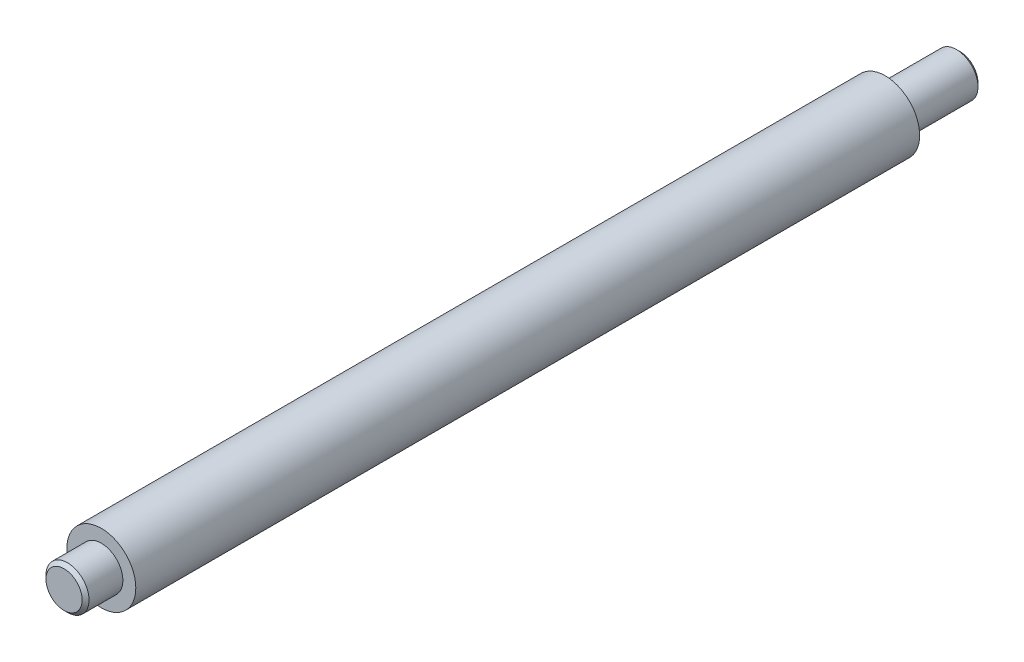
ISO-10303-21;
HEADER;
FILE_DESCRIPTION(('STEP AP214'),'2;1');
FILE_NAME('part.step','',(''),(''),'','','');
FILE_SCHEMA(('AUTOMOTIVE_DESIGN { 1 0 10303 214 1 1 1 1 }'));
ENDSEC;
DATA;
#1=APPLICATION_CONTEXT('core data for automotive mechanical design processes');
#2=APPLICATION_PROTOCOL_DEFINITION('international standard','automotive_design',2000,#1);
#3=PRODUCT_CONTEXT('',#1,'mechanical');
#4=PRODUCT('Part','Part','',(#3));
#5=PRODUCT_RELATED_PRODUCT_CATEGORY('part','',(#4));
#6=PRODUCT_DEFINITION_FORMATION('','',#4);
#7=PRODUCT_DEFINITION_CONTEXT('part definition',#1,'design');
#8=PRODUCT_DEFINITION('design','',#6,#7);
#9=PRODUCT_DEFINITION_SHAPE('','',#8);
#10=(LENGTH_UNIT() NAMED_UNIT(*) SI_UNIT(.MILLI.,.METRE.));
#11=(NAMED_UNIT(*) PLANE_ANGLE_UNIT() SI_UNIT($,.RADIAN.));
#12=(NAMED_UNIT(*) SI_UNIT($,.STERADIAN.) SOLID_ANGLE_UNIT());
#13=UNCERTAINTY_MEASURE_WITH_UNIT(LENGTH_MEASURE(1.E-05),#10,'distance_accuracy_value','');
#14=(GEOMETRIC_REPRESENTATION_CONTEXT(3) GLOBAL_UNCERTAINTY_ASSIGNED_CONTEXT((#13)) GLOBAL_UNIT_ASSIGNED_CONTEXT((#10,
#11,#12)) REPRESENTATION_CONTEXT('',''));
#15=CARTESIAN_POINT('',(0.,0.,0.));
#16=DIRECTION('',(0.,0.,1.));
#17=DIRECTION('',(1.,0.,0.));
#18=AXIS2_PLACEMENT_3D('',#15,#16,#17);
#19=CARTESIAN_POINT('',(0.,0.,-330.2));
#20=DIRECTION('',(0.,0.,1.));
#21=DIRECTION('',(1.,0.,0.));
#22=AXIS2_PLACEMENT_3D('',#19,#20,#21);
#23=CYLINDRICAL_SURFACE('',#22,12.7);
#24=CARTESIAN_POINT('',(0.,0.,-302.6664));
#25=DIRECTION('',(0.,0.,-1.));
#26=DIRECTION('',(-1.,0.,0.));
#27=AXIS2_PLACEMENT_3D('',#24,#25,#26);
#28=CIRCLE('',#27,12.7);
#29=CARTESIAN_POINT('',(-12.7,0.,-302.6664));
#30=VERTEX_POINT('',#29);
#31=EDGE_CURVE('E57',#30,#30,#28,.T.);
#32=ORIENTED_EDGE('',*,*,#31,.F.);
#33=EDGE_LOOP('',(#32));
#34=FACE_BOUND('',#33,.T.);
#35=CARTESIAN_POINT('',(0.,0.,-13.7414));
#36=DIRECTION('',(0.,0.,1.));
#37=DIRECTION('',(1.,0.,0.));
#38=AXIS2_PLACEMENT_3D('',#35,#36,#37);
#39=CIRCLE('',#38,12.7);
#40=CARTESIAN_POINT('',(12.7,0.,-13.7414));
#41=VERTEX_POINT('',#40);
#42=EDGE_CURVE('E63',#41,#41,#39,.T.);
#43=ORIENTED_EDGE('',*,*,#42,.F.);
#44=EDGE_LOOP('',(#43));
#45=FACE_BOUND('',#44,.T.);
#46=ADVANCED_FACE('F37',(#34,#45),#23,.T.);
#47=CARTESIAN_POINT('',(0.,0.,-302.6664));
#48=DIRECTION('',(0.,0.,-1.));
#49=DIRECTION('',(-1.,0.,0.));
#50=AXIS2_PLACEMENT_3D('',#47,#48,#49);
#51=PLANE('',#50);
#52=CARTESIAN_POINT('',(0.,0.,-302.6664));
#53=DIRECTION('',(0.,0.,-1.));
#54=DIRECTION('',(-1.,0.,0.));
#55=AXIS2_PLACEMENT_3D('',#52,#53,#54);
#56=CIRCLE('',#55,7.9375);
#57=CARTESIAN_POINT('',(-7.9375,0.,-302.6664));
#58=VERTEX_POINT('',#57);
#59=EDGE_CURVE('E60',#58,#58,#56,.T.);
#60=ORIENTED_EDGE('',*,*,#59,.F.);
#61=EDGE_LOOP('',(#60));
#62=FACE_BOUND('',#61,.T.);
#63=ORIENTED_EDGE('',*,*,#31,.T.);
#64=EDGE_LOOP('',(#63));
#65=FACE_BOUND('',#64,.T.);
#66=ADVANCED_FACE('F80',(#62,#65),#51,.T.);
#67=CARTESIAN_POINT('',(0.,0.,-302.6664));
#68=DIRECTION('',(0.,0.,-1.));
#69=DIRECTION('',(-1.,0.,0.));
#70=AXIS2_PLACEMENT_3D('',#67,#68,#69);
#71=CYLINDRICAL_SURFACE('',#70,7.9375);
#72=CARTESIAN_POINT('',(0.,0.,-328.93));
#73=DIRECTION('',(0.,0.,1.));
#74=DIRECTION('',(1.,0.,0.));
#75=AXIS2_PLACEMENT_3D('',#72,#73,#74);
#76=CIRCLE('',#75,7.9375);
#77=CARTESIAN_POINT('',(7.9375,0.,-328.93));
#78=VERTEX_POINT('',#77);
#79=EDGE_CURVE('E48',#78,#78,#76,.T.);
#80=ORIENTED_EDGE('',*,*,#79,.T.);
#81=EDGE_LOOP('',(#80));
#82=FACE_BOUND('',#81,.T.);
#83=ORIENTED_EDGE('',*,*,#59,.T.);
#84=EDGE_LOOP('',(#83));
#85=FACE_BOUND('',#84,.T.);
#86=ADVANCED_FACE('F86',(#82,#85),#71,.T.);
#87=CARTESIAN_POINT('',(0.,0.,-330.2));
#88=DIRECTION('',(0.,0.,1.));
#89=DIRECTION('',(1.,0.,0.));
#90=AXIS2_PLACEMENT_3D('',#87,#88,#89);
#91=PLANE('',#90);
#92=CARTESIAN_POINT('',(0.,0.,-330.2));
#93=DIRECTION('',(0.,0.,1.));
#94=DIRECTION('',(1.,0.,0.));
#95=AXIS2_PLACEMENT_3D('',#92,#93,#94);
#96=CIRCLE('',#95,6.66749999999994);
#97=CARTESIAN_POINT('',(6.66749999999994,0.,-330.2));
#98=VERTEX_POINT('',#97);
#99=EDGE_CURVE('E52',#98,#98,#96,.F.);
#100=ORIENTED_EDGE('',*,*,#99,.T.);
#101=EDGE_LOOP('',(#100));
#102=FACE_BOUND('',#101,.T.);
#103=ADVANCED_FACE('F75',(#102),#91,.F.);
#104=CARTESIAN_POINT('',(0.,0.,-13.7414));
#105=DIRECTION('',(0.,0.,1.));
#106=DIRECTION('',(1.,0.,0.));
#107=AXIS2_PLACEMENT_3D('',#104,#105,#106);
#108=PLANE('',#107);
#109=CARTESIAN_POINT('',(0.,0.,-13.7414));
#110=DIRECTION('',(0.,0.,1.));
#111=DIRECTION('',(1.,0.,0.));
#112=AXIS2_PLACEMENT_3D('',#109,#110,#111);
#113=CIRCLE('',#112,7.9375);
#114=CARTESIAN_POINT('',(7.9375,0.,-13.7414));
#115=VERTEX_POINT('',#114);
#116=EDGE_CURVE('E66',#115,#115,#113,.T.);
#117=ORIENTED_EDGE('',*,*,#116,.F.);
#118=EDGE_LOOP('',(#117));
#119=FACE_BOUND('',#118,.T.);
#120=ORIENTED_EDGE('',*,*,#42,.T.);
#121=EDGE_LOOP('',(#120));
#122=FACE_BOUND('',#121,.T.);
#123=ADVANCED_FACE('F72',(#119,#122),#108,.T.);
#124=CARTESIAN_POINT('',(0.,0.,-13.7414));
#125=DIRECTION('',(0.,0.,1.));
#126=DIRECTION('',(1.,0.,0.));
#127=AXIS2_PLACEMENT_3D('',#124,#125,#126);
#128=CYLINDRICAL_SURFACE('',#127,7.9375);
#129=CARTESIAN_POINT('',(0.,0.,-1.27000000000002));
#130=DIRECTION('',(0.,0.,1.));
#131=DIRECTION('',(1.,0.,0.));
#132=AXIS2_PLACEMENT_3D('',#129,#130,#131);
#133=CIRCLE('',#132,7.9375);
#134=CARTESIAN_POINT('',(7.9375,0.,-1.27000000000002));
#135=VERTEX_POINT('',#134);
#136=EDGE_CURVE('E10',#135,#135,#133,.F.);
#137=ORIENTED_EDGE('',*,*,#136,.T.);
#138=EDGE_LOOP('',(#137));
#139=FACE_BOUND('',#138,.T.);
#140=ORIENTED_EDGE('',*,*,#116,.T.);
#141=EDGE_LOOP('',(#140));
#142=FACE_BOUND('',#141,.T.);
#143=ADVANCED_FACE('F70',(#139,#142),#128,.T.);
#144=CARTESIAN_POINT('',(0.,0.,0.));
#145=DIRECTION('',(0.,0.,1.));
#146=DIRECTION('',(1.,0.,0.));
#147=AXIS2_PLACEMENT_3D('',#144,#145,#146);
#148=PLANE('',#147);
#149=CARTESIAN_POINT('',(0.,0.,0.));
#150=DIRECTION('',(0.,0.,1.));
#151=DIRECTION('',(1.,0.,0.));
#152=AXIS2_PLACEMENT_3D('',#149,#150,#151);
#153=CIRCLE('',#152,6.66749999999996);
#154=CARTESIAN_POINT('',(6.66749999999996,0.,0.));
#155=VERTEX_POINT('',#154);
#156=EDGE_CURVE('E44',#155,#155,#153,.T.);
#157=ORIENTED_EDGE('',*,*,#156,.T.);
#158=EDGE_LOOP('',(#157));
#159=FACE_BOUND('',#158,.T.);
#160=ADVANCED_FACE('F91',(#159),#148,.T.);
#161=CARTESIAN_POINT('',(0.,0.,-330.2));
#162=DIRECTION('',(0.,0.,1.));
#163=DIRECTION('',(1.,0.,0.));
#164=AXIS2_PLACEMENT_3D('',#161,#162,#163);
#165=CONICAL_SURFACE('',#164,6.66749999999994,0.785398163397454);
#166=ORIENTED_EDGE('',*,*,#79,.F.);
#167=EDGE_LOOP('',(#166));
#168=FACE_BOUND('',#167,.T.);
#169=ORIENTED_EDGE('',*,*,#99,.F.);
#170=EDGE_LOOP('',(#169));
#171=FACE_BOUND('',#170,.T.);
#172=ADVANCED_FACE('F93',(#168,#171),#165,.T.);
#173=CARTESIAN_POINT('',(0.,0.,0.));
#174=DIRECTION('',(0.,0.,-1.));
#175=DIRECTION('',(-1.,0.,0.));
#176=AXIS2_PLACEMENT_3D('',#173,#174,#175);
#177=CONICAL_SURFACE('',#176,6.66749999999996,0.785398163397455);
#178=ORIENTED_EDGE('',*,*,#136,.F.);
#179=EDGE_LOOP('',(#178));
#180=FACE_BOUND('',#179,.T.);
#181=ORIENTED_EDGE('',*,*,#156,.F.);
#182=EDGE_LOOP('',(#181));
#183=FACE_BOUND('',#182,.T.);
#184=ADVANCED_FACE('F39',(#180,#183),#177,.T.);
#185=CLOSED_SHELL('',(#46,#66,#86,#103,#123,#143,#160,#172,#184));
#186=MANIFOLD_SOLID_BREP('B2',#185);
#187=ADVANCED_BREP_SHAPE_REPRESENTATION('',(#18,#186),#14);
#188=SHAPE_DEFINITION_REPRESENTATION(#9,#187);
ENDSEC;
END-ISO-10303-21;
